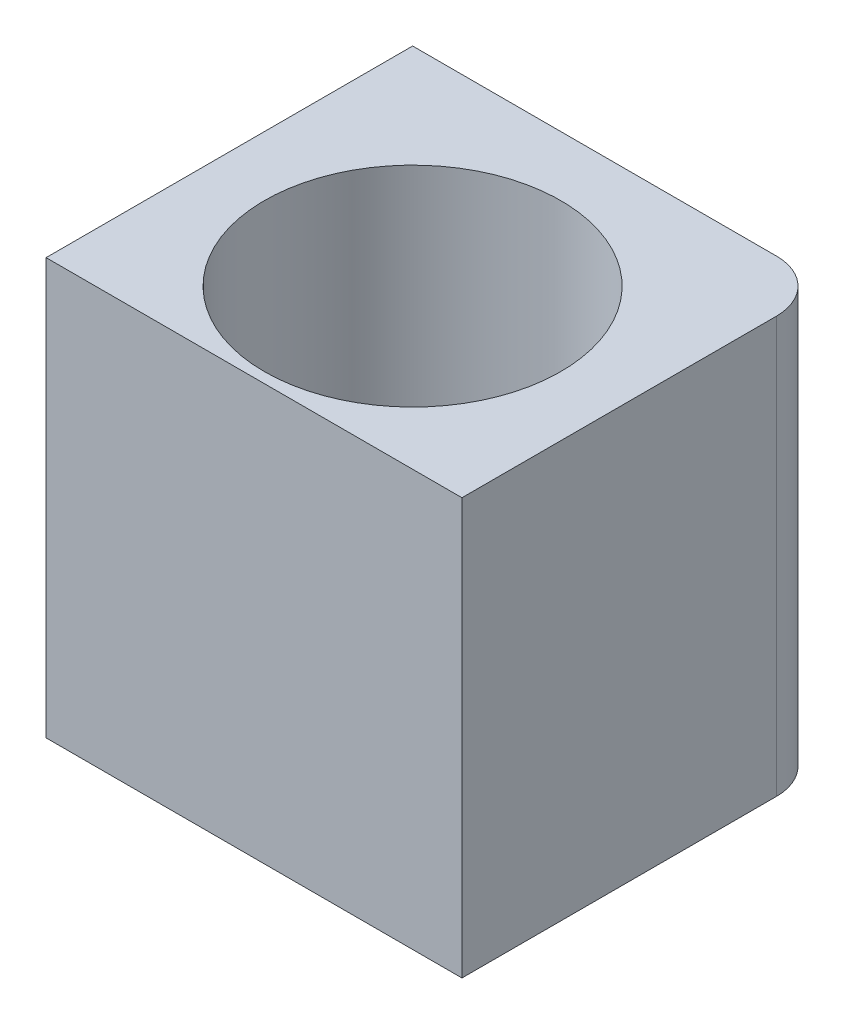
ISO-10303-21;
HEADER;
FILE_DESCRIPTION(('STEP AP214'),'2;1');
FILE_NAME('part.step','',(''),(''),'','','');
FILE_SCHEMA(('AUTOMOTIVE_DESIGN { 1 0 10303 214 1 1 1 1 }'));
ENDSEC;
DATA;
#1=APPLICATION_CONTEXT('core data for automotive mechanical design processes');
#2=APPLICATION_PROTOCOL_DEFINITION('international standard','automotive_design',2000,#1);
#3=PRODUCT_CONTEXT('',#1,'mechanical');
#4=PRODUCT('Part','Part','',(#3));
#5=PRODUCT_RELATED_PRODUCT_CATEGORY('part','',(#4));
#6=PRODUCT_DEFINITION_FORMATION('','',#4);
#7=PRODUCT_DEFINITION_CONTEXT('part definition',#1,'design');
#8=PRODUCT_DEFINITION('design','',#6,#7);
#9=PRODUCT_DEFINITION_SHAPE('','',#8);
#10=(LENGTH_UNIT() NAMED_UNIT(*) SI_UNIT(.MILLI.,.METRE.));
#11=(NAMED_UNIT(*) PLANE_ANGLE_UNIT() SI_UNIT($,.RADIAN.));
#12=(NAMED_UNIT(*) SI_UNIT($,.STERADIAN.) SOLID_ANGLE_UNIT());
#13=UNCERTAINTY_MEASURE_WITH_UNIT(LENGTH_MEASURE(1.E-05),#10,'distance_accuracy_value','');
#14=(GEOMETRIC_REPRESENTATION_CONTEXT(3) GLOBAL_UNCERTAINTY_ASSIGNED_CONTEXT((#13)) GLOBAL_UNIT_ASSIGNED_CONTEXT((#10,
#11,#12)) REPRESENTATION_CONTEXT('',''));
#15=CARTESIAN_POINT('',(0.,0.,0.));
#16=DIRECTION('',(0.,0.,1.));
#17=DIRECTION('',(1.,0.,0.));
#18=AXIS2_PLACEMENT_3D('',#15,#16,#17);
#19=CARTESIAN_POINT('',(0.,20.,0.));
#20=DIRECTION('',(0.,1.,0.));
#21=DIRECTION('',(0.,0.,1.));
#22=AXIS2_PLACEMENT_3D('',#19,#20,#21);
#23=CYLINDRICAL_SURFACE('',#22,14.25);
#24=CARTESIAN_POINT('',(0.,30.,0.));
#25=DIRECTION('',(0.,1.,0.));
#26=DIRECTION('',(0.,0.,1.));
#27=AXIS2_PLACEMENT_3D('',#24,#25,#26);
#28=CIRCLE('',#27,14.25);
#29=CARTESIAN_POINT('',(0.,30.,14.25));
#30=VERTEX_POINT('',#29);
#31=EDGE_CURVE('E153',#30,#30,#28,.F.);
#32=ORIENTED_EDGE('',*,*,#31,.T.);
#33=EDGE_LOOP('',(#32));
#34=FACE_BOUND('',#33,.T.);
#35=CARTESIAN_POINT('',(0.,70.,0.));
#36=DIRECTION('',(0.,1.,0.));
#37=DIRECTION('',(0.,0.,1.));
#38=AXIS2_PLACEMENT_3D('',#35,#36,#37);
#39=CIRCLE('',#38,14.25);
#40=CARTESIAN_POINT('',(0.,70.,14.25));
#41=VERTEX_POINT('',#40);
#42=EDGE_CURVE('E144',#41,#41,#39,.T.);
#43=ORIENTED_EDGE('',*,*,#42,.T.);
#44=EDGE_LOOP('',(#43));
#45=FACE_BOUND('',#44,.T.);
#46=ADVANCED_FACE('F56',(#34,#45),#23,.F.);
#47=CARTESIAN_POINT('',(15.,70.,-15.));
#48=DIRECTION('',(0.,1.,0.));
#49=DIRECTION('',(0.,0.,1.));
#50=AXIS2_PLACEMENT_3D('',#47,#48,#49);
#51=PLANE('',#50);
#52=DIRECTION('',(1.,0.,0.));
#53=VECTOR('',#52,1.);
#54=CARTESIAN_POINT('',(-19.9936005393496,70.,15.25));
#55=LINE('',#54,#53);
#56=CARTESIAN_POINT('',(-19.9936005393496,70.,15.25));
#57=VERTEX_POINT('',#56);
#58=CARTESIAN_POINT('',(20.,70.,15.25));
#59=VERTEX_POINT('',#58);
#60=EDGE_CURVE('E141',#57,#59,#55,.T.);
#61=ORIENTED_EDGE('',*,*,#60,.T.);
#62=DIRECTION('',(0.,0.,-1.));
#63=VECTOR('',#62,1.);
#64=CARTESIAN_POINT('',(20.,70.,15.25));
#65=LINE('',#64,#63);
#66=CARTESIAN_POINT('',(20.,70.,-15.));
#67=VERTEX_POINT('',#66);
#68=EDGE_CURVE('E117',#59,#67,#65,.T.);
#69=ORIENTED_EDGE('',*,*,#68,.T.);
#70=CARTESIAN_POINT('',(15.,70.,-15.));
#71=DIRECTION('',(0.,1.,0.));
#72=DIRECTION('',(0.,0.,1.));
#73=AXIS2_PLACEMENT_3D('',#70,#71,#72);
#74=CIRCLE('',#73,5.);
#75=CARTESIAN_POINT('',(15.,70.,-20.));
#76=VERTEX_POINT('',#75);
#77=EDGE_CURVE('E135',#67,#76,#74,.T.);
#78=ORIENTED_EDGE('',*,*,#77,.T.);
#79=DIRECTION('',(-1.,0.,0.));
#80=VECTOR('',#79,1.);
#81=CARTESIAN_POINT('',(15.,70.,-20.));
#82=LINE('',#81,#80);
#83=CARTESIAN_POINT('',(-19.9936005393496,70.,-20.));
#84=VERTEX_POINT('',#83);
#85=EDGE_CURVE('E124',#76,#84,#82,.T.);
#86=ORIENTED_EDGE('',*,*,#85,.T.);
#87=DIRECTION('',(0.,0.,1.));
#88=VECTOR('',#87,1.);
#89=CARTESIAN_POINT('',(-19.9936005393496,70.,-20.));
#90=LINE('',#89,#88);
#91=EDGE_CURVE('E120',#84,#57,#90,.T.);
#92=ORIENTED_EDGE('',*,*,#91,.T.);
#93=EDGE_LOOP('',(#61,#69,#78,#86,#92));
#94=FACE_BOUND('',#93,.T.);
#95=ORIENTED_EDGE('',*,*,#42,.F.);
#96=EDGE_LOOP('',(#95));
#97=FACE_BOUND('',#96,.T.);
#98=ADVANCED_FACE('F137',(#94,#97),#51,.T.);
#99=CARTESIAN_POINT('',(15.,25.,-15.));
#100=DIRECTION('',(0.,-1.,0.));
#101=DIRECTION('',(0.,0.,-1.));
#102=AXIS2_PLACEMENT_3D('',#99,#100,#101);
#103=CYLINDRICAL_SURFACE('',#102,5.);
#104=DIRECTION('',(0.,-1.,0.));
#105=VECTOR('',#104,1.);
#106=CARTESIAN_POINT('',(20.,20.,-15.));
#107=LINE('',#106,#105);
#108=CARTESIAN_POINT('',(20.,30.,-15.));
#109=VERTEX_POINT('',#108);
#110=EDGE_CURVE('E130',#67,#109,#107,.T.);
#111=ORIENTED_EDGE('',*,*,#110,.T.);
#112=CARTESIAN_POINT('',(15.,30.,-15.));
#113=DIRECTION('',(0.,1.,0.));
#114=DIRECTION('',(0.,0.,1.));
#115=AXIS2_PLACEMENT_3D('',#112,#113,#114);
#116=CIRCLE('',#115,5.);
#117=CARTESIAN_POINT('',(15.,30.,-20.));
#118=VERTEX_POINT('',#117);
#119=EDGE_CURVE('E104',#109,#118,#116,.T.);
#120=ORIENTED_EDGE('',*,*,#119,.T.);
#121=DIRECTION('',(0.,-1.,0.));
#122=VECTOR('',#121,1.);
#123=CARTESIAN_POINT('',(15.,25.,-20.));
#124=LINE('',#123,#122);
#125=EDGE_CURVE('E122',#76,#118,#124,.T.);
#126=ORIENTED_EDGE('',*,*,#125,.F.);
#127=ORIENTED_EDGE('',*,*,#77,.F.);
#128=EDGE_LOOP('',(#111,#120,#126,#127));
#129=FACE_BOUND('',#128,.T.);
#130=ADVANCED_FACE('F133',(#129),#103,.T.);
#131=CARTESIAN_POINT('',(-19.9936005393496,30.,-20.));
#132=DIRECTION('',(1.,0.,0.));
#133=DIRECTION('',(0.,0.,-1.));
#134=AXIS2_PLACEMENT_3D('',#131,#132,#133);
#135=PLANE('',#134);
#136=DIRECTION('',(0.,1.,0.));
#137=VECTOR('',#136,1.);
#138=CARTESIAN_POINT('',(-19.9936005393496,20.,-20.));
#139=LINE('',#138,#137);
#140=CARTESIAN_POINT('',(-19.9936005393496,30.,-20.));
#141=VERTEX_POINT('',#140);
#142=EDGE_CURVE('E119',#141,#84,#139,.T.);
#143=ORIENTED_EDGE('',*,*,#142,.F.);
#144=DIRECTION('',(0.,0.,1.));
#145=VECTOR('',#144,1.);
#146=CARTESIAN_POINT('',(-19.9936005393496,30.,-20.));
#147=LINE('',#146,#145);
#148=CARTESIAN_POINT('',(-19.9936005393496,30.,15.25));
#149=VERTEX_POINT('',#148);
#150=EDGE_CURVE('E12',#141,#149,#147,.T.);
#151=ORIENTED_EDGE('',*,*,#150,.T.);
#152=DIRECTION('',(0.,1.,0.));
#153=VECTOR('',#152,1.);
#154=CARTESIAN_POINT('',(-19.9936005393496,0.,15.25));
#155=LINE('',#154,#153);
#156=EDGE_CURVE('E64',#149,#57,#155,.T.);
#157=ORIENTED_EDGE('',*,*,#156,.T.);
#158=ORIENTED_EDGE('',*,*,#91,.F.);
#159=EDGE_LOOP('',(#143,#151,#157,#158));
#160=FACE_BOUND('',#159,.T.);
#161=ADVANCED_FACE('F149',(#160),#135,.F.);
#162=CARTESIAN_POINT('',(0.,0.,15.25));
#163=DIRECTION('',(0.,0.,1.));
#164=DIRECTION('',(1.,0.,0.));
#165=AXIS2_PLACEMENT_3D('',#162,#163,#164);
#166=PLANE('',#165);
#167=DIRECTION('',(-1.,0.,0.));
#168=VECTOR('',#167,1.);
#169=CARTESIAN_POINT('',(20.,30.,15.25));
#170=LINE('',#169,#168);
#171=CARTESIAN_POINT('',(20.,30.,15.25));
#172=VERTEX_POINT('',#171);
#173=EDGE_CURVE('E71',#172,#149,#170,.T.);
#174=ORIENTED_EDGE('',*,*,#173,.F.);
#175=DIRECTION('',(0.,-1.,0.));
#176=VECTOR('',#175,1.);
#177=CARTESIAN_POINT('',(20.,30.,15.25));
#178=LINE('',#177,#176);
#179=EDGE_CURVE('E112',#59,#172,#178,.T.);
#180=ORIENTED_EDGE('',*,*,#179,.F.);
#181=ORIENTED_EDGE('',*,*,#60,.F.);
#182=ORIENTED_EDGE('',*,*,#156,.F.);
#183=EDGE_LOOP('',(#174,#180,#181,#182));
#184=FACE_BOUND('',#183,.T.);
#185=ADVANCED_FACE('F110',(#184),#166,.T.);
#186=CARTESIAN_POINT('',(20.,20.,0.));
#187=DIRECTION('',(-1.,0.,0.));
#188=DIRECTION('',(0.,0.,1.));
#189=AXIS2_PLACEMENT_3D('',#186,#187,#188);
#190=PLANE('',#189);
#191=ORIENTED_EDGE('',*,*,#179,.T.);
#192=DIRECTION('',(0.,0.,-1.));
#193=VECTOR('',#192,1.);
#194=CARTESIAN_POINT('',(20.,30.,15.25));
#195=LINE('',#194,#193);
#196=EDGE_CURVE('E100',#172,#109,#195,.T.);
#197=ORIENTED_EDGE('',*,*,#196,.T.);
#198=ORIENTED_EDGE('',*,*,#110,.F.);
#199=ORIENTED_EDGE('',*,*,#68,.F.);
#200=EDGE_LOOP('',(#191,#197,#198,#199));
#201=FACE_BOUND('',#200,.T.);
#202=ADVANCED_FACE('F58',(#201),#190,.F.);
#203=CARTESIAN_POINT('',(0.,20.,-20.));
#204=DIRECTION('',(0.,0.,1.));
#205=DIRECTION('',(1.,0.,0.));
#206=AXIS2_PLACEMENT_3D('',#203,#204,#205);
#207=PLANE('',#206);
#208=ORIENTED_EDGE('',*,*,#125,.T.);
#209=DIRECTION('',(-1.,0.,0.));
#210=VECTOR('',#209,1.);
#211=CARTESIAN_POINT('',(20.,30.,-20.));
#212=LINE('',#211,#210);
#213=EDGE_CURVE('E114',#118,#141,#212,.T.);
#214=ORIENTED_EDGE('',*,*,#213,.T.);
#215=ORIENTED_EDGE('',*,*,#142,.T.);
#216=ORIENTED_EDGE('',*,*,#85,.F.);
#217=EDGE_LOOP('',(#208,#214,#215,#216));
#218=FACE_BOUND('',#217,.T.);
#219=ADVANCED_FACE('F151',(#218),#207,.F.);
#220=CARTESIAN_POINT('',(15.,30.,-15.));
#221=DIRECTION('',(0.,1.,0.));
#222=DIRECTION('',(0.,0.,1.));
#223=AXIS2_PLACEMENT_3D('',#220,#221,#222);
#224=PLANE('',#223);
#225=ORIENTED_EDGE('',*,*,#196,.F.);
#226=ORIENTED_EDGE('',*,*,#173,.T.);
#227=ORIENTED_EDGE('',*,*,#150,.F.);
#228=ORIENTED_EDGE('',*,*,#213,.F.);
#229=ORIENTED_EDGE('',*,*,#119,.F.);
#230=EDGE_LOOP('',(#225,#226,#227,#228,#229));
#231=FACE_BOUND('',#230,.T.);
#232=ORIENTED_EDGE('',*,*,#31,.F.);
#233=EDGE_LOOP('',(#232));
#234=FACE_BOUND('',#233,.T.);
#235=ADVANCED_FACE('F101',(#231,#234),#224,.F.);
#236=CLOSED_SHELL('',(#46,#98,#130,#161,#185,#202,#219,#235));
#237=MANIFOLD_SOLID_BREP('B2',#236);
#238=ADVANCED_BREP_SHAPE_REPRESENTATION('',(#18,#237),#14);
#239=SHAPE_DEFINITION_REPRESENTATION(#9,#238);
ENDSEC;
END-ISO-10303-21;
